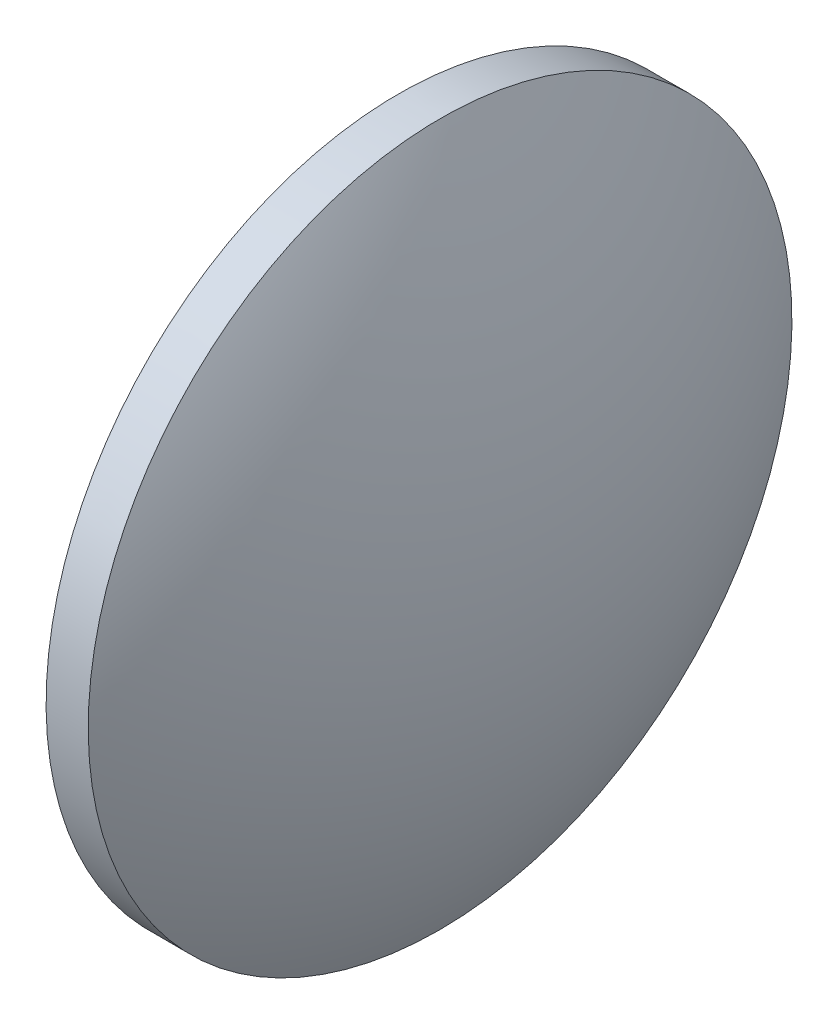
ISO-10303-21;
HEADER;
FILE_DESCRIPTION(('STEP AP214'),'2;1');
FILE_NAME('part.step','',(''),(''),'','','');
FILE_SCHEMA(('AUTOMOTIVE_DESIGN { 1 0 10303 214 1 1 1 1 }'));
ENDSEC;
DATA;
#1=APPLICATION_CONTEXT('core data for automotive mechanical design processes');
#2=APPLICATION_PROTOCOL_DEFINITION('international standard','automotive_design',2000,#1);
#3=PRODUCT_CONTEXT('',#1,'mechanical');
#4=PRODUCT('Part','Part','',(#3));
#5=PRODUCT_RELATED_PRODUCT_CATEGORY('part','',(#4));
#6=PRODUCT_DEFINITION_FORMATION('','',#4);
#7=PRODUCT_DEFINITION_CONTEXT('part definition',#1,'design');
#8=PRODUCT_DEFINITION('design','',#6,#7);
#9=PRODUCT_DEFINITION_SHAPE('','',#8);
#10=(LENGTH_UNIT() NAMED_UNIT(*) SI_UNIT(.MILLI.,.METRE.));
#11=(NAMED_UNIT(*) PLANE_ANGLE_UNIT() SI_UNIT($,.RADIAN.));
#12=(NAMED_UNIT(*) SI_UNIT($,.STERADIAN.) SOLID_ANGLE_UNIT());
#13=UNCERTAINTY_MEASURE_WITH_UNIT(LENGTH_MEASURE(1.E-05),#10,'distance_accuracy_value','');
#14=(GEOMETRIC_REPRESENTATION_CONTEXT(3) GLOBAL_UNCERTAINTY_ASSIGNED_CONTEXT((#13)) GLOBAL_UNIT_ASSIGNED_CONTEXT((#10,
#11,#12)) REPRESENTATION_CONTEXT('',''));
#15=CARTESIAN_POINT('',(0.,0.,0.));
#16=DIRECTION('',(0.,0.,1.));
#17=DIRECTION('',(1.,0.,0.));
#18=AXIS2_PLACEMENT_3D('',#15,#16,#17);
#19=CARTESIAN_POINT('',(516.908474595167,118.068546489873,0.));
#20=DIRECTION('',(0.,0.,-1.));
#21=DIRECTION('',(-0.00194244466169369,-0.999998113452589,0.));
#22=AXIS2_PLACEMENT_3D('',#19,#20,#21);
#23=CIRCLE('',#22,51.6746124031007);
#24=TRIMMED_CURVE('',#23,(PARAMETER_VALUE(-1.56920910623187)),
(PARAMETER_VALUE(1.56920910623187)),.T.,.PARAMETER.);
#25=CARTESIAN_POINT('',(516.90831527785,117.986527671651,0.));
#26=DIRECTION('',(-0.999998113452589,0.00194244466169369,0.));
#27=AXIS1_PLACEMENT('',#25,#26);
#28=SURFACE_OF_REVOLUTION('',#24,#27);
#29=CARTESIAN_POINT('',(562.084196019432,117.898775857719,0.));
#30=DIRECTION('',(-0.999998113452589,0.00194244466169369,0.));
#31=DIRECTION('',(-0.00194244466169369,-0.999998113452589,0.));
#32=AXIS2_PLACEMENT_3D('',#29,#30,#31);
#33=CIRCLE('',#32,25.0057801702998);
#34=CARTESIAN_POINT('',(562.035623675228,92.8930428620096,0.));
#35=VERTEX_POINT('',#34);
#36=EDGE_CURVE('E11',#35,#35,#33,.T.);
#37=ORIENTED_EDGE('',*,*,#36,.F.);
#38=EDGE_LOOP('',(#37));
#39=FACE_BOUND('',#38,.T.);
#40=CARTESIAN_POINT('',(568.582765103354,117.88615272308,0.));
#41=VERTEX_POINT('',#40);
#42=VERTEX_LOOP('',#41);
#43=FACE_BOUND('',#42,.T.);
#44=ADVANCED_FACE('F37',(#39,#43),#28,.T.);
#45=CARTESIAN_POINT('',(562.084196019432,117.898775857719,0.));
#46=DIRECTION('',(0.999998113452589,-0.00194244466169369,0.));
#47=DIRECTION('',(0.00194244466169369,0.999998113452589,0.));
#48=AXIS2_PLACEMENT_3D('',#45,#46,#47);
#49=CONICAL_SURFACE('',#48,25.0057801702998,0.00194244588319864);
#50=CARTESIAN_POINT('',(559.084207338706,117.904603180711,0.));
#51=DIRECTION('',(-0.999998113452589,0.00194244466169369,0.));
#52=DIRECTION('',(-0.00194244466169369,-0.999998113452589,0.));
#53=AXIS2_PLACEMENT_3D('',#50,#51,#52);
#54=CIRCLE('',#53,24.9999528363147);
#55=CARTESIAN_POINT('',(559.035646313776,92.9046975079927,0.));
#56=VERTEX_POINT('',#55);
#57=EDGE_CURVE('E44',#56,#56,#54,.T.);
#58=ORIENTED_EDGE('',*,*,#57,.F.);
#59=EDGE_LOOP('',(#58));
#60=FACE_BOUND('',#59,.T.);
#61=ORIENTED_EDGE('',*,*,#36,.T.);
#62=EDGE_LOOP('',(#61));
#63=FACE_BOUND('',#62,.T.);
#64=ADVANCED_FACE('F53',(#60,#63),#49,.T.);
#65=CARTESIAN_POINT('',(559.084207338706,117.904603180711,0.));
#66=DIRECTION('',(-0.999998113452589,0.00194244466169369,0.));
#67=DIRECTION('',(-0.00194244466169369,-0.999998113452589,0.));
#68=AXIS2_PLACEMENT_3D('',#65,#66,#67);
#69=CONICAL_SURFACE('',#68,24.9999528363147,1.5688538809117);
#70=CARTESIAN_POINT('',(559.132768363635,117.904508853429,0.));
#71=VERTEX_POINT('',#70);
#72=VERTEX_LOOP('',#71);
#73=FACE_BOUND('',#72,.T.);
#74=ORIENTED_EDGE('',*,*,#57,.T.);
#75=EDGE_LOOP('',(#74));
#76=FACE_BOUND('',#75,.T.);
#77=ADVANCED_FACE('F50',(#73,#76),#69,.F.);
#78=CLOSED_SHELL('',(#44,#64,#77));
#79=MANIFOLD_SOLID_BREP('B2',#78);
#80=ADVANCED_BREP_SHAPE_REPRESENTATION('',(#18,#79),#14);
#81=SHAPE_DEFINITION_REPRESENTATION(#9,#80);
ENDSEC;
END-ISO-10303-21;
